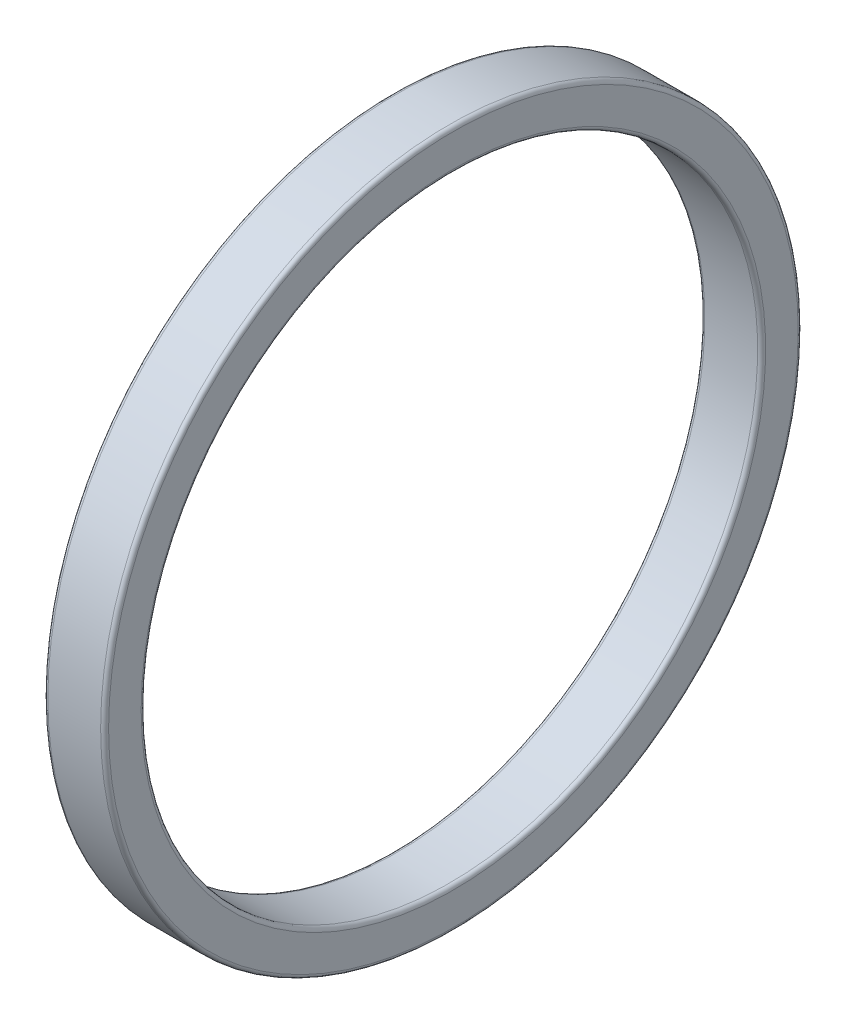
ISO-10303-21;
HEADER;
FILE_DESCRIPTION(('STEP AP214'),'2;1');
FILE_NAME('part.step','',(''),(''),'','','');
FILE_SCHEMA(('AUTOMOTIVE_DESIGN { 1 0 10303 214 1 1 1 1 }'));
ENDSEC;
DATA;
#1=APPLICATION_CONTEXT('core data for automotive mechanical design processes');
#2=APPLICATION_PROTOCOL_DEFINITION('international standard','automotive_design',2000,#1);
#3=PRODUCT_CONTEXT('',#1,'mechanical');
#4=PRODUCT('Part','Part','',(#3));
#5=PRODUCT_RELATED_PRODUCT_CATEGORY('part','',(#4));
#6=PRODUCT_DEFINITION_FORMATION('','',#4);
#7=PRODUCT_DEFINITION_CONTEXT('part definition',#1,'design');
#8=PRODUCT_DEFINITION('design','',#6,#7);
#9=PRODUCT_DEFINITION_SHAPE('','',#8);
#10=(LENGTH_UNIT() NAMED_UNIT(*) SI_UNIT(.MILLI.,.METRE.));
#11=(NAMED_UNIT(*) PLANE_ANGLE_UNIT() SI_UNIT($,.RADIAN.));
#12=(NAMED_UNIT(*) SI_UNIT($,.STERADIAN.) SOLID_ANGLE_UNIT());
#13=UNCERTAINTY_MEASURE_WITH_UNIT(LENGTH_MEASURE(1.E-05),#10,'distance_accuracy_value','');
#14=(GEOMETRIC_REPRESENTATION_CONTEXT(3) GLOBAL_UNCERTAINTY_ASSIGNED_CONTEXT((#13)) GLOBAL_UNIT_ASSIGNED_CONTEXT((#10,
#11,#12)) REPRESENTATION_CONTEXT('',''));
#15=CARTESIAN_POINT('',(0.,0.,0.));
#16=DIRECTION('',(0.,0.,1.));
#17=DIRECTION('',(1.,0.,0.));
#18=AXIS2_PLACEMENT_3D('',#15,#16,#17);
#19=CARTESIAN_POINT('',(-276.767408806867,0.,0.));
#20=DIRECTION('',(-1.,0.,0.));
#21=DIRECTION('',(0.,0.,1.));
#22=AXIS2_PLACEMENT_3D('',#19,#20,#21);
#23=TOROIDAL_SURFACE('',#22,17.2892,0.199999999999988);
#24=CARTESIAN_POINT('',(-276.767408806867,0.,0.));
#25=DIRECTION('',(-1.,0.,0.));
#26=DIRECTION('',(0.,0.,1.));
#27=AXIS2_PLACEMENT_3D('',#24,#25,#26);
#28=CIRCLE('',#27,17.4892);
#29=CARTESIAN_POINT('',(-276.767408806867,0.,17.4892));
#30=VERTEX_POINT('',#29);
#31=EDGE_CURVE('E67',#30,#30,#28,.T.);
#32=ORIENTED_EDGE('',*,*,#31,.F.);
#33=EDGE_LOOP('',(#32));
#34=FACE_BOUND('',#33,.T.);
#35=CARTESIAN_POINT('',(-276.567408806867,0.,0.));
#36=DIRECTION('',(-1.,0.,0.));
#37=DIRECTION('',(0.,0.,1.));
#38=AXIS2_PLACEMENT_3D('',#35,#36,#37);
#39=CIRCLE('',#38,17.2892);
#40=CARTESIAN_POINT('',(-276.567408806867,0.,17.2892));
#41=VERTEX_POINT('',#40);
#42=EDGE_CURVE('E10',#41,#41,#39,.T.);
#43=ORIENTED_EDGE('',*,*,#42,.T.);
#44=EDGE_LOOP('',(#43));
#45=FACE_BOUND('',#44,.T.);
#46=ADVANCED_FACE('F39',(#34,#45),#23,.T.);
#47=CARTESIAN_POINT('',(-276.567408806867,15.6572000000001,0.));
#48=DIRECTION('',(-1.,0.,0.));
#49=DIRECTION('',(0.,0.,1.));
#50=AXIS2_PLACEMENT_3D('',#47,#48,#49);
#51=PLANE('',#50);
#52=ORIENTED_EDGE('',*,*,#42,.F.);
#53=EDGE_LOOP('',(#52));
#54=FACE_BOUND('',#53,.T.);
#55=CARTESIAN_POINT('',(-276.567408806867,0.,0.));
#56=DIRECTION('',(-1.,0.,0.));
#57=DIRECTION('',(0.,0.,1.));
#58=AXIS2_PLACEMENT_3D('',#55,#56,#57);
#59=CIRCLE('',#58,15.6572000000001);
#60=CARTESIAN_POINT('',(-276.567408806867,0.,15.6572000000001));
#61=VERTEX_POINT('',#60);
#62=EDGE_CURVE('E45',#61,#61,#59,.T.);
#63=ORIENTED_EDGE('',*,*,#62,.T.);
#64=EDGE_LOOP('',(#63));
#65=FACE_BOUND('',#64,.T.);
#66=ADVANCED_FACE('F74',(#54,#65),#51,.F.);
#67=CARTESIAN_POINT('',(-276.767408806867,0.,0.));
#68=DIRECTION('',(-1.,0.,0.));
#69=DIRECTION('',(0.,0.,1.));
#70=AXIS2_PLACEMENT_3D('',#67,#68,#69);
#71=TOROIDAL_SURFACE('',#70,15.6572000000001,0.199999999999989);
#72=ORIENTED_EDGE('',*,*,#62,.F.);
#73=EDGE_LOOP('',(#72));
#74=FACE_BOUND('',#73,.T.);
#75=CARTESIAN_POINT('',(-276.767408806867,0.,0.));
#76=DIRECTION('',(-1.,0.,0.));
#77=DIRECTION('',(0.,0.,1.));
#78=AXIS2_PLACEMENT_3D('',#75,#76,#77);
#79=CIRCLE('',#78,15.4572000000001);
#80=CARTESIAN_POINT('',(-276.767408806867,0.,15.4572000000001));
#81=VERTEX_POINT('',#80);
#82=EDGE_CURVE('E49',#81,#81,#79,.T.);
#83=ORIENTED_EDGE('',*,*,#82,.T.);
#84=EDGE_LOOP('',(#83));
#85=FACE_BOUND('',#84,.T.);
#86=ADVANCED_FACE('F78',(#74,#85),#71,.T.);
#87=CARTESIAN_POINT('',(-295.311631147883,0.,0.));
#88=DIRECTION('',(-1.,0.,0.));
#89=DIRECTION('',(0.,0.,1.));
#90=AXIS2_PLACEMENT_3D('',#87,#88,#89);
#91=CYLINDRICAL_SURFACE('',#90,15.4572000000001);
#92=ORIENTED_EDGE('',*,*,#82,.F.);
#93=EDGE_LOOP('',(#92));
#94=FACE_BOUND('',#93,.T.);
#95=CARTESIAN_POINT('',(-279.415408806867,0.,0.));
#96=DIRECTION('',(-1.,0.,0.));
#97=DIRECTION('',(0.,0.,1.));
#98=AXIS2_PLACEMENT_3D('',#95,#96,#97);
#99=CIRCLE('',#98,15.4572000000001);
#100=CARTESIAN_POINT('',(-279.415408806867,0.,15.4572000000001));
#101=VERTEX_POINT('',#100);
#102=EDGE_CURVE('E53',#101,#101,#99,.T.);
#103=ORIENTED_EDGE('',*,*,#102,.T.);
#104=EDGE_LOOP('',(#103));
#105=FACE_BOUND('',#104,.T.);
#106=ADVANCED_FACE('F83',(#94,#105),#91,.F.);
#107=CARTESIAN_POINT('',(-279.415408806867,0.,0.));
#108=DIRECTION('',(-1.,0.,0.));
#109=DIRECTION('',(0.,0.,1.));
#110=AXIS2_PLACEMENT_3D('',#107,#108,#109);
#111=TOROIDAL_SURFACE('',#110,15.6572000000001,0.199999999999989);
#112=ORIENTED_EDGE('',*,*,#102,.F.);
#113=EDGE_LOOP('',(#112));
#114=FACE_BOUND('',#113,.T.);
#115=CARTESIAN_POINT('',(-279.615408806867,0.,0.));
#116=DIRECTION('',(-1.,0.,0.));
#117=DIRECTION('',(0.,0.,1.));
#118=AXIS2_PLACEMENT_3D('',#115,#116,#117);
#119=CIRCLE('',#118,15.6572000000001);
#120=CARTESIAN_POINT('',(-279.615408806867,0.,15.6572000000001));
#121=VERTEX_POINT('',#120);
#122=EDGE_CURVE('E58',#121,#121,#119,.T.);
#123=ORIENTED_EDGE('',*,*,#122,.T.);
#124=EDGE_LOOP('',(#123));
#125=FACE_BOUND('',#124,.T.);
#126=ADVANCED_FACE('F89',(#114,#125),#111,.T.);
#127=CARTESIAN_POINT('',(-279.615408806867,15.6572000000001,0.));
#128=DIRECTION('',(1.,0.,0.));
#129=DIRECTION('',(0.,0.,-1.));
#130=AXIS2_PLACEMENT_3D('',#127,#128,#129);
#131=PLANE('',#130);
#132=ORIENTED_EDGE('',*,*,#122,.F.);
#133=EDGE_LOOP('',(#132));
#134=FACE_BOUND('',#133,.T.);
#135=CARTESIAN_POINT('',(-279.615408806867,0.,0.));
#136=DIRECTION('',(-1.,0.,0.));
#137=DIRECTION('',(0.,0.,1.));
#138=AXIS2_PLACEMENT_3D('',#135,#136,#137);
#139=CIRCLE('',#138,17.2892);
#140=CARTESIAN_POINT('',(-279.615408806867,0.,17.2892));
#141=VERTEX_POINT('',#140);
#142=EDGE_CURVE('E61',#141,#141,#139,.T.);
#143=ORIENTED_EDGE('',*,*,#142,.T.);
#144=EDGE_LOOP('',(#143));
#145=FACE_BOUND('',#144,.T.);
#146=ADVANCED_FACE('F93',(#134,#145),#131,.F.);
#147=CARTESIAN_POINT('',(-279.415408806867,0.,0.));
#148=DIRECTION('',(-1.,0.,0.));
#149=DIRECTION('',(0.,0.,1.));
#150=AXIS2_PLACEMENT_3D('',#147,#148,#149);
#151=TOROIDAL_SURFACE('',#150,17.2892,0.199999999999988);
#152=ORIENTED_EDGE('',*,*,#142,.F.);
#153=EDGE_LOOP('',(#152));
#154=FACE_BOUND('',#153,.T.);
#155=CARTESIAN_POINT('',(-279.415408806867,0.,0.));
#156=DIRECTION('',(-1.,0.,0.));
#157=DIRECTION('',(0.,0.,1.));
#158=AXIS2_PLACEMENT_3D('',#155,#156,#157);
#159=CIRCLE('',#158,17.4892);
#160=CARTESIAN_POINT('',(-279.415408806867,0.,17.4892));
#161=VERTEX_POINT('',#160);
#162=EDGE_CURVE('E64',#161,#161,#159,.T.);
#163=ORIENTED_EDGE('',*,*,#162,.T.);
#164=EDGE_LOOP('',(#163));
#165=FACE_BOUND('',#164,.T.);
#166=ADVANCED_FACE('F97',(#154,#165),#151,.T.);
#167=CARTESIAN_POINT('',(-295.311631147883,0.,0.));
#168=DIRECTION('',(-1.,0.,0.));
#169=DIRECTION('',(0.,0.,1.));
#170=AXIS2_PLACEMENT_3D('',#167,#168,#169);
#171=CYLINDRICAL_SURFACE('',#170,17.4892);
#172=ORIENTED_EDGE('',*,*,#162,.F.);
#173=EDGE_LOOP('',(#172));
#174=FACE_BOUND('',#173,.T.);
#175=ORIENTED_EDGE('',*,*,#31,.T.);
#176=EDGE_LOOP('',(#175));
#177=FACE_BOUND('',#176,.T.);
#178=ADVANCED_FACE('F71',(#174,#177),#171,.T.);
#179=CLOSED_SHELL('',(#46,#66,#86,#106,#126,#146,#166,#178));
#180=MANIFOLD_SOLID_BREP('B2',#179);
#181=ADVANCED_BREP_SHAPE_REPRESENTATION('',(#18,#180),#14);
#182=SHAPE_DEFINITION_REPRESENTATION(#9,#181);
ENDSEC;
END-ISO-10303-21;
